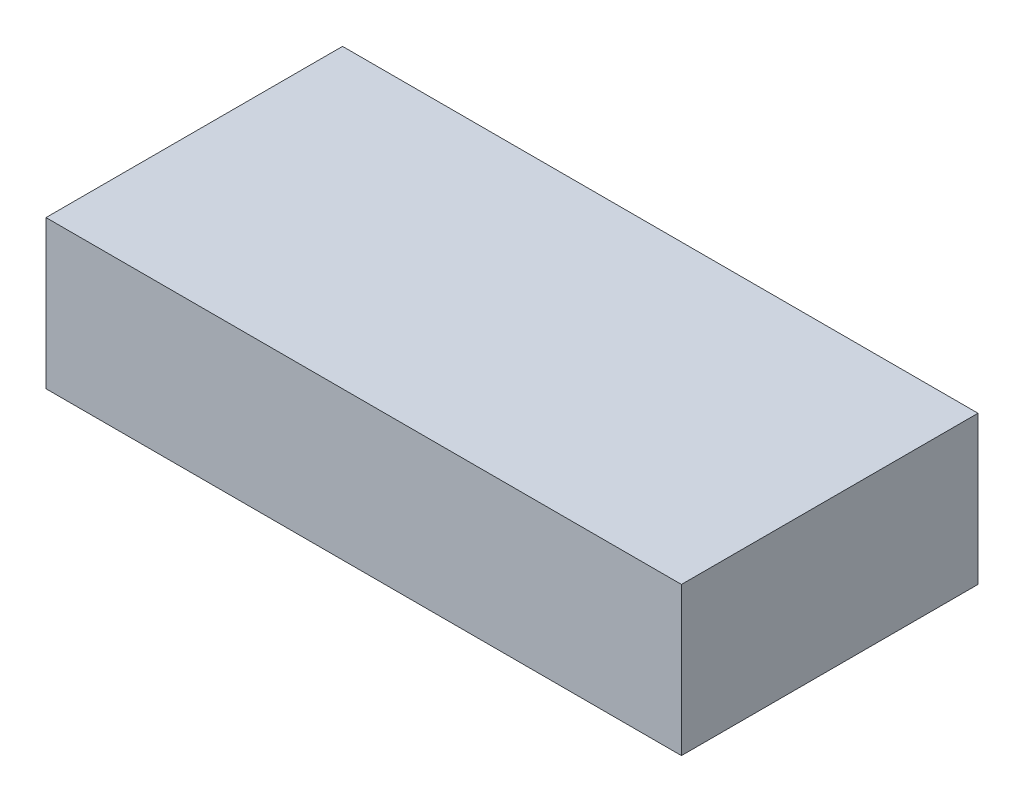
ISO-10303-21;
HEADER;
FILE_DESCRIPTION(('STEP AP214'),'2;1');
FILE_NAME('part.step','',(''),(''),'','','');
FILE_SCHEMA(('AUTOMOTIVE_DESIGN { 1 0 10303 214 1 1 1 1 }'));
ENDSEC;
DATA;
#1=APPLICATION_CONTEXT('core data for automotive mechanical design processes');
#2=APPLICATION_PROTOCOL_DEFINITION('international standard','automotive_design',2000,#1);
#3=PRODUCT_CONTEXT('',#1,'mechanical');
#4=PRODUCT('Part','Part','',(#3));
#5=PRODUCT_RELATED_PRODUCT_CATEGORY('part','',(#4));
#6=PRODUCT_DEFINITION_FORMATION('','',#4);
#7=PRODUCT_DEFINITION_CONTEXT('part definition',#1,'design');
#8=PRODUCT_DEFINITION('design','',#6,#7);
#9=PRODUCT_DEFINITION_SHAPE('','',#8);
#10=(LENGTH_UNIT() NAMED_UNIT(*) SI_UNIT(.MILLI.,.METRE.));
#11=(NAMED_UNIT(*) PLANE_ANGLE_UNIT() SI_UNIT($,.RADIAN.));
#12=(NAMED_UNIT(*) SI_UNIT($,.STERADIAN.) SOLID_ANGLE_UNIT());
#13=UNCERTAINTY_MEASURE_WITH_UNIT(LENGTH_MEASURE(1.E-05),#10,'distance_accuracy_value','');
#14=(GEOMETRIC_REPRESENTATION_CONTEXT(3) GLOBAL_UNCERTAINTY_ASSIGNED_CONTEXT((#13)) GLOBAL_UNIT_ASSIGNED_CONTEXT((#10,
#11,#12)) REPRESENTATION_CONTEXT('',''));
#15=CARTESIAN_POINT('',(0.,0.,0.));
#16=DIRECTION('',(0.,0.,1.));
#17=DIRECTION('',(1.,0.,0.));
#18=AXIS2_PLACEMENT_3D('',#15,#16,#17);
#19=CARTESIAN_POINT('',(15.,7.,7.));
#20=DIRECTION('',(-1.,0.,0.));
#21=DIRECTION('',(0.,0.,1.));
#22=AXIS2_PLACEMENT_3D('',#19,#20,#21);
#23=PLANE('',#22);
#24=DIRECTION('',(0.,0.,-1.));
#25=VECTOR('',#24,1.);
#26=CARTESIAN_POINT('',(15.,0.,7.));
#27=LINE('',#26,#25);
#28=CARTESIAN_POINT('',(15.,0.,7.));
#29=VERTEX_POINT('',#28);
#30=CARTESIAN_POINT('',(15.,0.,-7.));
#31=VERTEX_POINT('',#30);
#32=EDGE_CURVE('E95',#29,#31,#27,.T.);
#33=ORIENTED_EDGE('',*,*,#32,.T.);
#34=DIRECTION('',(0.,-1.,0.));
#35=VECTOR('',#34,1.);
#36=CARTESIAN_POINT('',(15.,7.,-7.));
#37=LINE('',#36,#35);
#38=CARTESIAN_POINT('',(15.,7.,-7.));
#39=VERTEX_POINT('',#38);
#40=EDGE_CURVE('E11',#39,#31,#37,.T.);
#41=ORIENTED_EDGE('',*,*,#40,.F.);
#42=DIRECTION('',(0.,0.,-1.));
#43=VECTOR('',#42,1.);
#44=CARTESIAN_POINT('',(15.,7.,7.));
#45=LINE('',#44,#43);
#46=CARTESIAN_POINT('',(15.,7.,7.));
#47=VERTEX_POINT('',#46);
#48=EDGE_CURVE('E83',#47,#39,#45,.T.);
#49=ORIENTED_EDGE('',*,*,#48,.F.);
#50=DIRECTION('',(0.,-1.,0.));
#51=VECTOR('',#50,1.);
#52=CARTESIAN_POINT('',(15.,7.,7.));
#53=LINE('',#52,#51);
#54=EDGE_CURVE('E91',#47,#29,#53,.T.);
#55=ORIENTED_EDGE('',*,*,#54,.T.);
#56=EDGE_LOOP('',(#33,#41,#49,#55));
#57=FACE_BOUND('',#56,.T.);
#58=ADVANCED_FACE('F32',(#57),#23,.F.);
#59=CARTESIAN_POINT('',(-15.,7.,-7.));
#60=DIRECTION('',(0.,0.,1.));
#61=DIRECTION('',(1.,0.,0.));
#62=AXIS2_PLACEMENT_3D('',#59,#60,#61);
#63=PLANE('',#62);
#64=DIRECTION('',(-1.,0.,0.));
#65=VECTOR('',#64,1.);
#66=CARTESIAN_POINT('',(-15.,0.,-7.));
#67=LINE('',#66,#65);
#68=CARTESIAN_POINT('',(-15.,0.,-7.));
#69=VERTEX_POINT('',#68);
#70=EDGE_CURVE('E87',#31,#69,#67,.T.);
#71=ORIENTED_EDGE('',*,*,#70,.T.);
#72=DIRECTION('',(0.,-1.,0.));
#73=VECTOR('',#72,1.);
#74=CARTESIAN_POINT('',(-15.,7.,-7.));
#75=LINE('',#74,#73);
#76=CARTESIAN_POINT('',(-15.,7.,-7.));
#77=VERTEX_POINT('',#76);
#78=EDGE_CURVE('E40',#77,#69,#75,.T.);
#79=ORIENTED_EDGE('',*,*,#78,.F.);
#80=DIRECTION('',(-1.,0.,0.));
#81=VECTOR('',#80,1.);
#82=CARTESIAN_POINT('',(-15.,7.,-7.));
#83=LINE('',#82,#81);
#84=EDGE_CURVE('E78',#39,#77,#83,.T.);
#85=ORIENTED_EDGE('',*,*,#84,.F.);
#86=ORIENTED_EDGE('',*,*,#40,.T.);
#87=EDGE_LOOP('',(#71,#79,#85,#86));
#88=FACE_BOUND('',#87,.T.);
#89=ADVANCED_FACE('F86',(#88),#63,.F.);
#90=CARTESIAN_POINT('',(-15.,7.,7.));
#91=DIRECTION('',(1.,0.,0.));
#92=DIRECTION('',(0.,0.,-1.));
#93=AXIS2_PLACEMENT_3D('',#90,#91,#92);
#94=PLANE('',#93);
#95=DIRECTION('',(0.,0.,1.));
#96=VECTOR('',#95,1.);
#97=CARTESIAN_POINT('',(-15.,0.,7.));
#98=LINE('',#97,#96);
#99=CARTESIAN_POINT('',(-15.,0.,7.));
#100=VERTEX_POINT('',#99);
#101=EDGE_CURVE('E65',#69,#100,#98,.T.);
#102=ORIENTED_EDGE('',*,*,#101,.T.);
#103=DIRECTION('',(0.,-1.,0.));
#104=VECTOR('',#103,1.);
#105=CARTESIAN_POINT('',(-15.,7.,7.));
#106=LINE('',#105,#104);
#107=CARTESIAN_POINT('',(-15.,7.,7.));
#108=VERTEX_POINT('',#107);
#109=EDGE_CURVE('E88',#108,#100,#106,.T.);
#110=ORIENTED_EDGE('',*,*,#109,.F.);
#111=DIRECTION('',(0.,0.,1.));
#112=VECTOR('',#111,1.);
#113=CARTESIAN_POINT('',(-15.,7.,7.));
#114=LINE('',#113,#112);
#115=EDGE_CURVE('E81',#77,#108,#114,.T.);
#116=ORIENTED_EDGE('',*,*,#115,.F.);
#117=ORIENTED_EDGE('',*,*,#78,.T.);
#118=EDGE_LOOP('',(#102,#110,#116,#117));
#119=FACE_BOUND('',#118,.T.);
#120=ADVANCED_FACE('F89',(#119),#94,.F.);
#121=CARTESIAN_POINT('',(-15.,7.,7.));
#122=DIRECTION('',(0.,0.,-1.));
#123=DIRECTION('',(-1.,0.,0.));
#124=AXIS2_PLACEMENT_3D('',#121,#122,#123);
#125=PLANE('',#124);
#126=DIRECTION('',(1.,0.,0.));
#127=VECTOR('',#126,1.);
#128=CARTESIAN_POINT('',(-15.,0.,7.));
#129=LINE('',#128,#127);
#130=EDGE_CURVE('E71',#100,#29,#129,.T.);
#131=ORIENTED_EDGE('',*,*,#130,.T.);
#132=ORIENTED_EDGE('',*,*,#54,.F.);
#133=DIRECTION('',(1.,0.,0.));
#134=VECTOR('',#133,1.);
#135=CARTESIAN_POINT('',(-15.,7.,7.));
#136=LINE('',#135,#134);
#137=EDGE_CURVE('E48',#108,#47,#136,.T.);
#138=ORIENTED_EDGE('',*,*,#137,.F.);
#139=ORIENTED_EDGE('',*,*,#109,.T.);
#140=EDGE_LOOP('',(#131,#132,#138,#139));
#141=FACE_BOUND('',#140,.T.);
#142=ADVANCED_FACE('F102',(#141),#125,.F.);
#143=CARTESIAN_POINT('',(0.,7.,0.));
#144=DIRECTION('',(0.,-1.,0.));
#145=DIRECTION('',(0.,0.,-1.));
#146=AXIS2_PLACEMENT_3D('',#143,#144,#145);
#147=PLANE('',#146);
#148=ORIENTED_EDGE('',*,*,#48,.T.);
#149=ORIENTED_EDGE('',*,*,#84,.T.);
#150=ORIENTED_EDGE('',*,*,#115,.T.);
#151=ORIENTED_EDGE('',*,*,#137,.T.);
#152=EDGE_LOOP('',(#148,#149,#150,#151));
#153=FACE_BOUND('',#152,.T.);
#154=ADVANCED_FACE('F79',(#153),#147,.F.);
#155=CARTESIAN_POINT('',(0.,0.,0.));
#156=DIRECTION('',(0.,-1.,0.));
#157=DIRECTION('',(0.,0.,-1.));
#158=AXIS2_PLACEMENT_3D('',#155,#156,#157);
#159=PLANE('',#158);
#160=ORIENTED_EDGE('',*,*,#32,.F.);
#161=ORIENTED_EDGE('',*,*,#130,.F.);
#162=ORIENTED_EDGE('',*,*,#101,.F.);
#163=ORIENTED_EDGE('',*,*,#70,.F.);
#164=EDGE_LOOP('',(#160,#161,#162,#163));
#165=FACE_BOUND('',#164,.T.);
#166=ADVANCED_FACE('F105',(#165),#159,.T.);
#167=CLOSED_SHELL('',(#58,#89,#120,#142,#154,#166));
#168=MANIFOLD_SOLID_BREP('B2',#167);
#169=ADVANCED_BREP_SHAPE_REPRESENTATION('',(#18,#168),#14);
#170=SHAPE_DEFINITION_REPRESENTATION(#9,#169);
ENDSEC;
END-ISO-10303-21;
